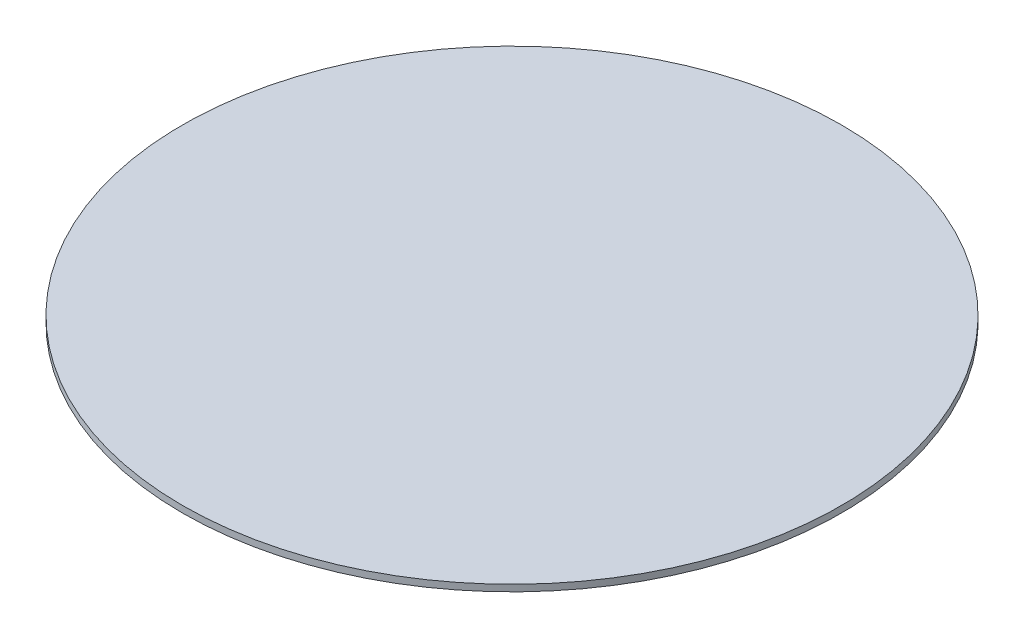
ISO-10303-21;
HEADER;
FILE_DESCRIPTION(('STEP AP214'),'2;1');
FILE_NAME('part.step','',(''),(''),'','','');
FILE_SCHEMA(('AUTOMOTIVE_DESIGN { 1 0 10303 214 1 1 1 1 }'));
ENDSEC;
DATA;
#1=APPLICATION_CONTEXT('core data for automotive mechanical design processes');
#2=APPLICATION_PROTOCOL_DEFINITION('international standard','automotive_design',2000,#1);
#3=PRODUCT_CONTEXT('',#1,'mechanical');
#4=PRODUCT('Part','Part','',(#3));
#5=PRODUCT_RELATED_PRODUCT_CATEGORY('part','',(#4));
#6=PRODUCT_DEFINITION_FORMATION('','',#4);
#7=PRODUCT_DEFINITION_CONTEXT('part definition',#1,'design');
#8=PRODUCT_DEFINITION('design','',#6,#7);
#9=PRODUCT_DEFINITION_SHAPE('','',#8);
#10=(LENGTH_UNIT() NAMED_UNIT(*) SI_UNIT(.MILLI.,.METRE.));
#11=(NAMED_UNIT(*) PLANE_ANGLE_UNIT() SI_UNIT($,.RADIAN.));
#12=(NAMED_UNIT(*) SI_UNIT($,.STERADIAN.) SOLID_ANGLE_UNIT());
#13=UNCERTAINTY_MEASURE_WITH_UNIT(LENGTH_MEASURE(1.E-05),#10,'distance_accuracy_value','');
#14=(GEOMETRIC_REPRESENTATION_CONTEXT(3) GLOBAL_UNCERTAINTY_ASSIGNED_CONTEXT((#13)) GLOBAL_UNIT_ASSIGNED_CONTEXT((#10,
#11,#12)) REPRESENTATION_CONTEXT('',''));
#15=CARTESIAN_POINT('',(0.,0.,0.));
#16=DIRECTION('',(0.,0.,1.));
#17=DIRECTION('',(1.,0.,0.));
#18=AXIS2_PLACEMENT_3D('',#15,#16,#17);
#19=CARTESIAN_POINT('',(0.,12.,0.));
#20=DIRECTION('',(0.,-1.,0.));
#21=DIRECTION('',(0.,0.,-1.));
#22=AXIS2_PLACEMENT_3D('',#19,#20,#21);
#23=CYLINDRICAL_SURFACE('',#22,600.);
#24=CARTESIAN_POINT('',(0.,12.,0.));
#25=DIRECTION('',(0.,1.,0.));
#26=DIRECTION('',(0.,0.,1.));
#27=AXIS2_PLACEMENT_3D('',#24,#25,#26);
#28=CIRCLE('',#27,600.);
#29=CARTESIAN_POINT('',(0.,12.,600.));
#30=VERTEX_POINT('',#29);
#31=EDGE_CURVE('E10',#30,#30,#28,.T.);
#32=ORIENTED_EDGE('',*,*,#31,.F.);
#33=EDGE_LOOP('',(#32));
#34=FACE_BOUND('',#33,.T.);
#35=CARTESIAN_POINT('',(0.,0.,0.));
#36=DIRECTION('',(0.,1.,0.));
#37=DIRECTION('',(0.,0.,1.));
#38=AXIS2_PLACEMENT_3D('',#35,#36,#37);
#39=CIRCLE('',#38,600.);
#40=CARTESIAN_POINT('',(0.,0.,600.));
#41=VERTEX_POINT('',#40);
#42=EDGE_CURVE('E36',#41,#41,#39,.T.);
#43=ORIENTED_EDGE('',*,*,#42,.T.);
#44=EDGE_LOOP('',(#43));
#45=FACE_BOUND('',#44,.T.);
#46=ADVANCED_FACE('F33',(#34,#45),#23,.T.);
#47=CARTESIAN_POINT('',(0.,12.,0.));
#48=DIRECTION('',(0.,1.,0.));
#49=DIRECTION('',(0.,0.,1.));
#50=AXIS2_PLACEMENT_3D('',#47,#48,#49);
#51=PLANE('',#50);
#52=ORIENTED_EDGE('',*,*,#31,.T.);
#53=EDGE_LOOP('',(#52));
#54=FACE_BOUND('',#53,.T.);
#55=ADVANCED_FACE('F48',(#54),#51,.T.);
#56=CARTESIAN_POINT('',(0.,0.,0.));
#57=DIRECTION('',(0.,1.,0.));
#58=DIRECTION('',(0.,0.,1.));
#59=AXIS2_PLACEMENT_3D('',#56,#57,#58);
#60=PLANE('',#59);
#61=ORIENTED_EDGE('',*,*,#42,.F.);
#62=EDGE_LOOP('',(#61));
#63=FACE_BOUND('',#62,.T.);
#64=ADVANCED_FACE('F46',(#63),#60,.F.);
#65=CLOSED_SHELL('',(#46,#55,#64));
#66=MANIFOLD_SOLID_BREP('B2',#65);
#67=ADVANCED_BREP_SHAPE_REPRESENTATION('',(#18,#66),#14);
#68=SHAPE_DEFINITION_REPRESENTATION(#9,#67);
ENDSEC;
END-ISO-10303-21;
